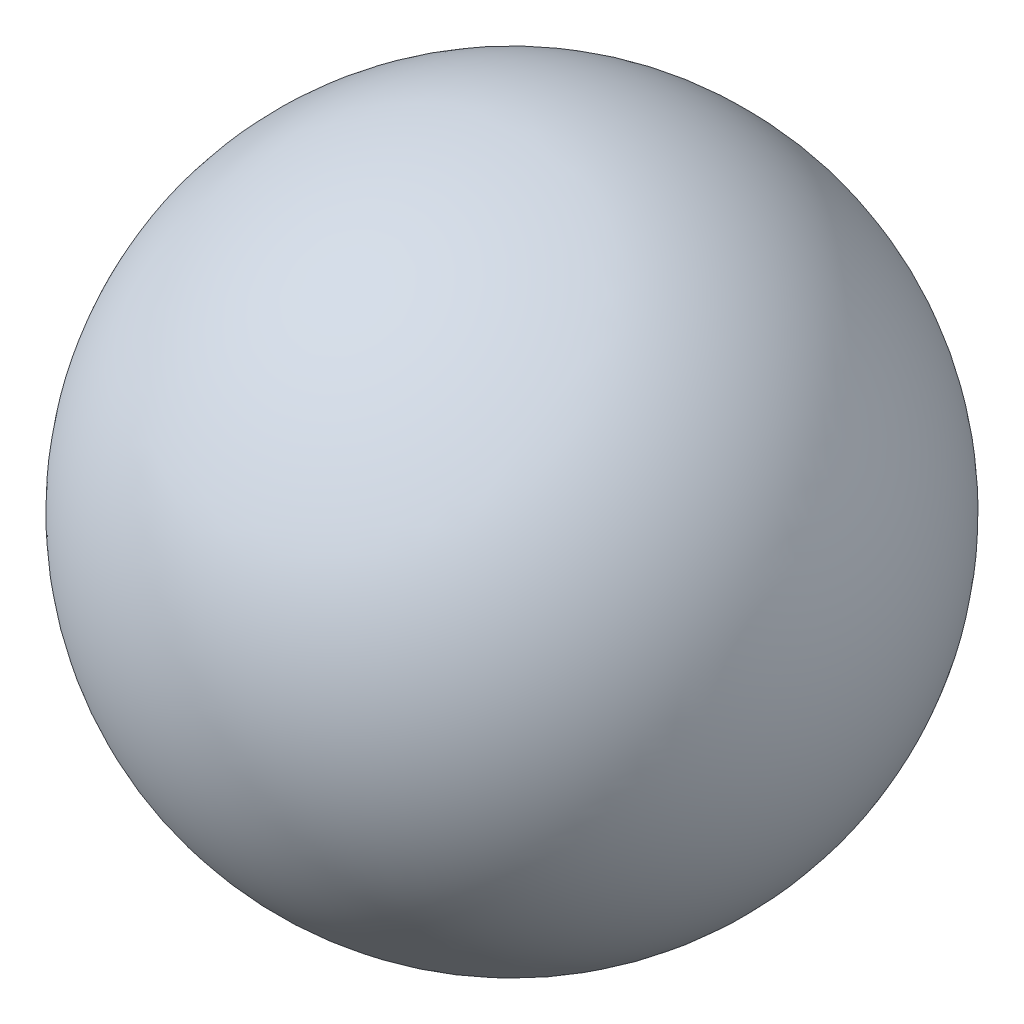
ISO-10303-21;
HEADER;
FILE_DESCRIPTION(('STEP AP214'),'2;1');
FILE_NAME('part.step','',(''),(''),'','','');
FILE_SCHEMA(('AUTOMOTIVE_DESIGN { 1 0 10303 214 1 1 1 1 }'));
ENDSEC;
DATA;
#1=APPLICATION_CONTEXT('core data for automotive mechanical design processes');
#2=APPLICATION_PROTOCOL_DEFINITION('international standard','automotive_design',2000,#1);
#3=PRODUCT_CONTEXT('',#1,'mechanical');
#4=PRODUCT('Part','Part','',(#3));
#5=PRODUCT_RELATED_PRODUCT_CATEGORY('part','',(#4));
#6=PRODUCT_DEFINITION_FORMATION('','',#4);
#7=PRODUCT_DEFINITION_CONTEXT('part definition',#1,'design');
#8=PRODUCT_DEFINITION('design','',#6,#7);
#9=PRODUCT_DEFINITION_SHAPE('','',#8);
#10=(LENGTH_UNIT() NAMED_UNIT(*) SI_UNIT(.MILLI.,.METRE.));
#11=(NAMED_UNIT(*) PLANE_ANGLE_UNIT() SI_UNIT($,.RADIAN.));
#12=(NAMED_UNIT(*) SI_UNIT($,.STERADIAN.) SOLID_ANGLE_UNIT());
#13=UNCERTAINTY_MEASURE_WITH_UNIT(LENGTH_MEASURE(1.E-05),#10,'distance_accuracy_value','');
#14=(GEOMETRIC_REPRESENTATION_CONTEXT(3) GLOBAL_UNCERTAINTY_ASSIGNED_CONTEXT((#13)) GLOBAL_UNIT_ASSIGNED_CONTEXT((#10,
#11,#12)) REPRESENTATION_CONTEXT('',''));
#15=CARTESIAN_POINT('',(0.,0.,0.));
#16=DIRECTION('',(0.,0.,1.));
#17=DIRECTION('',(1.,0.,0.));
#18=AXIS2_PLACEMENT_3D('',#15,#16,#17);
#19=CARTESIAN_POINT('',(0.,0.,0.));
#20=DIRECTION('',(-1.,0.,0.));
#21=DIRECTION('',(0.,1.,0.));
#22=AXIS2_PLACEMENT_3D('',#19,#20,#21);
#23=SPHERICAL_SURFACE('',#22,12.);
#24=CARTESIAN_POINT('',(-12.,0.,0.));
#25=VERTEX_POINT('',#24);
#26=VERTEX_LOOP('',#25);
#27=FACE_BOUND('',#26,.T.);
#28=ADVANCED_FACE('F37',(#27),#23,.T.);
#29=CLOSED_SHELL('',(#28));
#30=MANIFOLD_SOLID_BREP('B2',#29);
#31=ADVANCED_BREP_SHAPE_REPRESENTATION('',(#18,#30),#14);
#32=SHAPE_DEFINITION_REPRESENTATION(#9,#31);
ENDSEC;
END-ISO-10303-21;
